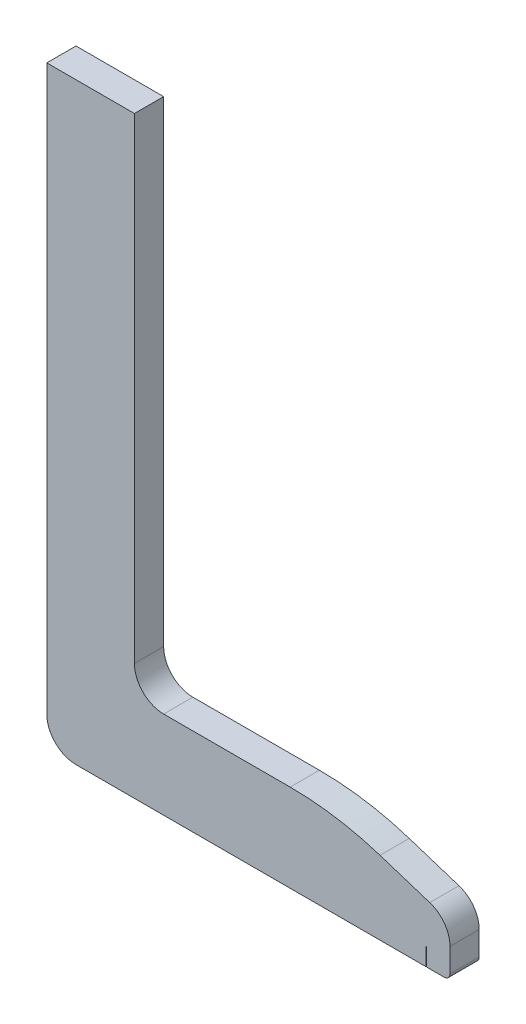
ISO-10303-21;
HEADER;
FILE_DESCRIPTION(('STEP AP214'),'2;1');
FILE_NAME('part.step','',(''),(''),'','','');
FILE_SCHEMA(('AUTOMOTIVE_DESIGN { 1 0 10303 214 1 1 1 1 }'));
ENDSEC;
DATA;
#1=APPLICATION_CONTEXT('core data for automotive mechanical design processes');
#2=APPLICATION_PROTOCOL_DEFINITION('international standard','automotive_design',2000,#1);
#3=PRODUCT_CONTEXT('',#1,'mechanical');
#4=PRODUCT('Part','Part','',(#3));
#5=PRODUCT_RELATED_PRODUCT_CATEGORY('part','',(#4));
#6=PRODUCT_DEFINITION_FORMATION('','',#4);
#7=PRODUCT_DEFINITION_CONTEXT('part definition',#1,'design');
#8=PRODUCT_DEFINITION('design','',#6,#7);
#9=PRODUCT_DEFINITION_SHAPE('','',#8);
#10=(LENGTH_UNIT() NAMED_UNIT(*) SI_UNIT(.MILLI.,.METRE.));
#11=(NAMED_UNIT(*) PLANE_ANGLE_UNIT() SI_UNIT($,.RADIAN.));
#12=(NAMED_UNIT(*) SI_UNIT($,.STERADIAN.) SOLID_ANGLE_UNIT());
#13=UNCERTAINTY_MEASURE_WITH_UNIT(LENGTH_MEASURE(1.E-05),#10,'distance_accuracy_value','');
#14=(GEOMETRIC_REPRESENTATION_CONTEXT(3) GLOBAL_UNCERTAINTY_ASSIGNED_CONTEXT((#13)) GLOBAL_UNIT_ASSIGNED_CONTEXT((#10,
#11,#12)) REPRESENTATION_CONTEXT('',''));
#15=CARTESIAN_POINT('',(0.,0.,0.));
#16=DIRECTION('',(0.,0.,1.));
#17=DIRECTION('',(1.,0.,0.));
#18=AXIS2_PLACEMENT_3D('',#15,#16,#17);
#19=CARTESIAN_POINT('',(5.,-101.5,5.));
#20=DIRECTION('',(0.,1.,0.));
#21=DIRECTION('',(-1.,0.,0.));
#22=AXIS2_PLACEMENT_3D('',#19,#20,#21);
#23=PLANE('',#22);
#24=DIRECTION('',(1.,0.,0.));
#25=VECTOR('',#24,1.);
#26=CARTESIAN_POINT('',(5.,-101.5,5.));
#27=LINE('',#26,#25);
#28=CARTESIAN_POINT('',(64.95,-101.5,5.));
#29=VERTEX_POINT('',#28);
#30=CARTESIAN_POINT('',(68.,-101.5,5.));
#31=VERTEX_POINT('',#30);
#32=EDGE_CURVE('E147',#29,#31,#27,.T.);
#33=ORIENTED_EDGE('',*,*,#32,.F.);
#34=DIRECTION('',(0.,0.,1.));
#35=VECTOR('',#34,1.);
#36=CARTESIAN_POINT('',(64.95,-101.5,0.));
#37=LINE('',#36,#35);
#38=CARTESIAN_POINT('',(64.95,-101.5,0.));
#39=VERTEX_POINT('',#38);
#40=EDGE_CURVE('E317',#39,#29,#37,.T.);
#41=ORIENTED_EDGE('',*,*,#40,.F.);
#42=DIRECTION('',(1.,0.,0.));
#43=VECTOR('',#42,1.);
#44=CARTESIAN_POINT('',(5.,-101.5,0.));
#45=LINE('',#44,#43);
#46=CARTESIAN_POINT('',(68.,-101.5,0.));
#47=VERTEX_POINT('',#46);
#48=EDGE_CURVE('E166',#39,#47,#45,.T.);
#49=ORIENTED_EDGE('',*,*,#48,.T.);
#50=DIRECTION('',(0.,0.,-1.));
#51=VECTOR('',#50,1.);
#52=CARTESIAN_POINT('',(68.,-101.5,5.));
#53=LINE('',#52,#51);
#54=EDGE_CURVE('E164',#31,#47,#53,.T.);
#55=ORIENTED_EDGE('',*,*,#54,.F.);
#56=EDGE_LOOP('',(#33,#41,#49,#55));
#57=FACE_BOUND('',#56,.T.);
#58=ADVANCED_FACE('F40',(#57),#23,.F.);
#59=CARTESIAN_POINT('',(64.,-96.4299960458087,5.));
#60=DIRECTION('',(0.,0.,-1.));
#61=DIRECTION('',(-1.,0.,0.));
#62=AXIS2_PLACEMENT_3D('',#59,#60,#61);
#63=CYLINDRICAL_SURFACE('',#62,5.);
#64=CARTESIAN_POINT('',(64.,-96.4299960458087,0.));
#65=DIRECTION('',(0.,0.,1.));
#66=DIRECTION('',(-1.,0.,0.));
#67=AXIS2_PLACEMENT_3D('',#64,#65,#66);
#68=CIRCLE('',#67,5.);
#69=CARTESIAN_POINT('',(69.,-96.4299960458087,0.));
#70=VERTEX_POINT('',#69);
#71=CARTESIAN_POINT('',(65.5368774299289,-91.6720544987345,0.));
#72=VERTEX_POINT('',#71);
#73=EDGE_CURVE('E183',#70,#72,#68,.T.);
#74=ORIENTED_EDGE('',*,*,#73,.T.);
#75=DIRECTION('',(0.,0.,-1.));
#76=VECTOR('',#75,1.);
#77=CARTESIAN_POINT('',(65.5368774299289,-91.6720544987345,5.));
#78=LINE('',#77,#76);
#79=CARTESIAN_POINT('',(65.5368774299289,-91.6720544987345,5.));
#80=VERTEX_POINT('',#79);
#81=EDGE_CURVE('E12',#80,#72,#78,.T.);
#82=ORIENTED_EDGE('',*,*,#81,.F.);
#83=CARTESIAN_POINT('',(64.,-96.4299960458087,5.));
#84=DIRECTION('',(0.,0.,1.));
#85=DIRECTION('',(-1.,0.,0.));
#86=AXIS2_PLACEMENT_3D('',#83,#84,#85);
#87=CIRCLE('',#86,5.);
#88=CARTESIAN_POINT('',(69.,-96.4299960458087,5.));
#89=VERTEX_POINT('',#88);
#90=EDGE_CURVE('E223',#89,#80,#87,.T.);
#91=ORIENTED_EDGE('',*,*,#90,.F.);
#92=DIRECTION('',(0.,0.,-1.));
#93=VECTOR('',#92,1.);
#94=CARTESIAN_POINT('',(69.,-96.4299960458087,5.));
#95=LINE('',#94,#93);
#96=EDGE_CURVE('E178',#89,#70,#95,.T.);
#97=ORIENTED_EDGE('',*,*,#96,.T.);
#98=EDGE_LOOP('',(#74,#82,#91,#97));
#99=FACE_BOUND('',#98,.T.);
#100=ADVANCED_FACE('F42',(#99),#63,.T.);
#101=CARTESIAN_POINT('',(65.5368774299289,-91.6720544987345,5.));
#102=DIRECTION('',(-0.307375485985788,-0.951588309414844,0.));
#103=DIRECTION('',(0.951588309414844,-0.307375485985788,0.));
#104=AXIS2_PLACEMENT_3D('',#101,#102,#103);
#105=PLANE('',#104);
#106=DIRECTION('',(-0.951588309414844,0.307375485985788,0.));
#107=VECTOR('',#106,1.);
#108=CARTESIAN_POINT('',(65.5368774299289,-91.6720544987345,0.));
#109=LINE('',#108,#107);
#110=CARTESIAN_POINT('',(57.0187399204818,-88.9205845292578,0.));
#111=VERTEX_POINT('',#110);
#112=EDGE_CURVE('E187',#72,#111,#109,.T.);
#113=ORIENTED_EDGE('',*,*,#112,.T.);
#114=DIRECTION('',(0.,0.,-1.));
#115=VECTOR('',#114,1.);
#116=CARTESIAN_POINT('',(57.0187399204818,-88.9205845292578,5.));
#117=LINE('',#116,#115);
#118=CARTESIAN_POINT('',(57.0187399204818,-88.9205845292578,5.));
#119=VERTEX_POINT('',#118);
#120=EDGE_CURVE('E49',#119,#111,#117,.T.);
#121=ORIENTED_EDGE('',*,*,#120,.F.);
#122=DIRECTION('',(-0.951588309414844,0.307375485985788,0.));
#123=VECTOR('',#122,1.);
#124=CARTESIAN_POINT('',(65.5368774299289,-91.6720544987345,5.));
#125=LINE('',#124,#123);
#126=EDGE_CURVE('E118',#80,#119,#125,.T.);
#127=ORIENTED_EDGE('',*,*,#126,.F.);
#128=ORIENTED_EDGE('',*,*,#81,.T.);
#129=EDGE_LOOP('',(#113,#121,#127,#128));
#130=FACE_BOUND('',#129,.T.);
#131=ADVANCED_FACE('F347',(#130),#105,.F.);
#132=CARTESIAN_POINT('',(41.6499656211925,-136.5,5.));
#133=DIRECTION('',(0.,0.,-1.));
#134=DIRECTION('',(-1.,0.,0.));
#135=AXIS2_PLACEMENT_3D('',#132,#133,#134);
#136=CYLINDRICAL_SURFACE('',#135,50.);
#137=CARTESIAN_POINT('',(41.6499656211925,-136.5,0.));
#138=DIRECTION('',(0.,0.,1.));
#139=DIRECTION('',(-1.,0.,0.));
#140=AXIS2_PLACEMENT_3D('',#137,#138,#139);
#141=CIRCLE('',#140,50.);
#142=CARTESIAN_POINT('',(41.6499656211925,-86.5,0.));
#143=VERTEX_POINT('',#142);
#144=EDGE_CURVE('E191',#111,#143,#141,.T.);
#145=ORIENTED_EDGE('',*,*,#144,.T.);
#146=DIRECTION('',(0.,0.,-1.));
#147=VECTOR('',#146,1.);
#148=CARTESIAN_POINT('',(41.6499656211925,-86.5,5.));
#149=LINE('',#148,#147);
#150=CARTESIAN_POINT('',(41.6499656211925,-86.5,5.));
#151=VERTEX_POINT('',#150);
#152=EDGE_CURVE('E251',#151,#143,#149,.T.);
#153=ORIENTED_EDGE('',*,*,#152,.F.);
#154=CARTESIAN_POINT('',(41.6499656211925,-136.5,5.));
#155=DIRECTION('',(0.,0.,1.));
#156=DIRECTION('',(-1.,0.,0.));
#157=AXIS2_PLACEMENT_3D('',#154,#155,#156);
#158=CIRCLE('',#157,50.);
#159=EDGE_CURVE('E261',#119,#151,#158,.T.);
#160=ORIENTED_EDGE('',*,*,#159,.F.);
#161=ORIENTED_EDGE('',*,*,#120,.T.);
#162=EDGE_LOOP('',(#145,#153,#160,#161));
#163=FACE_BOUND('',#162,.T.);
#164=ADVANCED_FACE('F259',(#163),#136,.T.);
#165=CARTESIAN_POINT('',(41.6499656211925,-86.5,5.));
#166=DIRECTION('',(0.,-1.,0.));
#167=DIRECTION('',(1.,0.,0.));
#168=AXIS2_PLACEMENT_3D('',#165,#166,#167);
#169=PLANE('',#168);
#170=DIRECTION('',(-1.,0.,0.));
#171=VECTOR('',#170,1.);
#172=CARTESIAN_POINT('',(41.6499656211925,-86.5,0.));
#173=LINE('',#172,#171);
#174=CARTESIAN_POINT('',(20.,-86.5,0.));
#175=VERTEX_POINT('',#174);
#176=EDGE_CURVE('E194',#143,#175,#173,.T.);
#177=ORIENTED_EDGE('',*,*,#176,.T.);
#178=DIRECTION('',(0.,0.,-1.));
#179=VECTOR('',#178,1.);
#180=CARTESIAN_POINT('',(20.,-86.5,5.));
#181=LINE('',#180,#179);
#182=CARTESIAN_POINT('',(20.,-86.5,5.));
#183=VERTEX_POINT('',#182);
#184=EDGE_CURVE('E247',#183,#175,#181,.T.);
#185=ORIENTED_EDGE('',*,*,#184,.F.);
#186=DIRECTION('',(-1.,0.,0.));
#187=VECTOR('',#186,1.);
#188=CARTESIAN_POINT('',(41.6499656211925,-86.5,5.));
#189=LINE('',#188,#187);
#190=EDGE_CURVE('E280',#151,#183,#189,.T.);
#191=ORIENTED_EDGE('',*,*,#190,.F.);
#192=ORIENTED_EDGE('',*,*,#152,.T.);
#193=EDGE_LOOP('',(#177,#185,#191,#192));
#194=FACE_BOUND('',#193,.T.);
#195=ADVANCED_FACE('F270',(#194),#169,.F.);
#196=CARTESIAN_POINT('',(20.,-81.5,5.));
#197=DIRECTION('',(0.,0.,-1.));
#198=DIRECTION('',(-1.,0.,0.));
#199=AXIS2_PLACEMENT_3D('',#196,#197,#198);
#200=CYLINDRICAL_SURFACE('',#199,5.00000000000001);
#201=CARTESIAN_POINT('',(20.,-81.5,0.));
#202=DIRECTION('',(0.,0.,-1.));
#203=DIRECTION('',(1.,0.,0.));
#204=AXIS2_PLACEMENT_3D('',#201,#202,#203);
#205=CIRCLE('',#204,5.00000000000001);
#206=CARTESIAN_POINT('',(15.,-81.5,0.));
#207=VERTEX_POINT('',#206);
#208=EDGE_CURVE('E197',#175,#207,#205,.T.);
#209=ORIENTED_EDGE('',*,*,#208,.T.);
#210=DIRECTION('',(0.,0.,-1.));
#211=VECTOR('',#210,1.);
#212=CARTESIAN_POINT('',(15.,-81.5,5.));
#213=LINE('',#212,#211);
#214=CARTESIAN_POINT('',(15.,-81.5,5.));
#215=VERTEX_POINT('',#214);
#216=EDGE_CURVE('E243',#215,#207,#213,.T.);
#217=ORIENTED_EDGE('',*,*,#216,.F.);
#218=CARTESIAN_POINT('',(20.,-81.5,5.));
#219=DIRECTION('',(0.,0.,-1.));
#220=DIRECTION('',(1.,0.,0.));
#221=AXIS2_PLACEMENT_3D('',#218,#219,#220);
#222=CIRCLE('',#221,5.00000000000001);
#223=EDGE_CURVE('E276',#183,#215,#222,.T.);
#224=ORIENTED_EDGE('',*,*,#223,.F.);
#225=ORIENTED_EDGE('',*,*,#184,.T.);
#226=EDGE_LOOP('',(#209,#217,#224,#225));
#227=FACE_BOUND('',#226,.T.);
#228=ADVANCED_FACE('F274',(#227),#200,.F.);
#229=CARTESIAN_POINT('',(15.,-61.,5.));
#230=DIRECTION('',(-1.,0.,0.));
#231=DIRECTION('',(0.,-1.,0.));
#232=AXIS2_PLACEMENT_3D('',#229,#230,#231);
#233=PLANE('',#232);
#234=DIRECTION('',(0.,1.,0.));
#235=VECTOR('',#234,1.);
#236=CARTESIAN_POINT('',(15.,-61.,0.));
#237=LINE('',#236,#235);
#238=CARTESIAN_POINT('',(15.,0.,0.));
#239=VERTEX_POINT('',#238);
#240=EDGE_CURVE('E201',#207,#239,#237,.T.);
#241=ORIENTED_EDGE('',*,*,#240,.T.);
#242=DIRECTION('',(0.,0.,-1.));
#243=VECTOR('',#242,1.);
#244=CARTESIAN_POINT('',(15.,0.,5.));
#245=LINE('',#244,#243);
#246=CARTESIAN_POINT('',(15.,0.,5.));
#247=VERTEX_POINT('',#246);
#248=EDGE_CURVE('E239',#247,#239,#245,.T.);
#249=ORIENTED_EDGE('',*,*,#248,.F.);
#250=DIRECTION('',(0.,1.,0.));
#251=VECTOR('',#250,1.);
#252=CARTESIAN_POINT('',(15.,-81.5,5.));
#253=LINE('',#252,#251);
#254=EDGE_CURVE('E279',#215,#247,#253,.T.);
#255=ORIENTED_EDGE('',*,*,#254,.F.);
#256=ORIENTED_EDGE('',*,*,#216,.T.);
#257=EDGE_LOOP('',(#241,#249,#255,#256));
#258=FACE_BOUND('',#257,.T.);
#259=ADVANCED_FACE('F376',(#258),#233,.F.);
#260=CARTESIAN_POINT('',(0.,0.,5.));
#261=DIRECTION('',(0.,-1.,0.));
#262=DIRECTION('',(1.,0.,0.));
#263=AXIS2_PLACEMENT_3D('',#260,#261,#262);
#264=PLANE('',#263);
#265=DIRECTION('',(-1.,0.,0.));
#266=VECTOR('',#265,1.);
#267=CARTESIAN_POINT('',(0.,0.,0.));
#268=LINE('',#267,#266);
#269=CARTESIAN_POINT('',(0.,0.,0.));
#270=VERTEX_POINT('',#269);
#271=EDGE_CURVE('E204',#239,#270,#268,.T.);
#272=ORIENTED_EDGE('',*,*,#271,.T.);
#273=DIRECTION('',(0.,0.,-1.));
#274=VECTOR('',#273,1.);
#275=CARTESIAN_POINT('',(0.,0.,5.));
#276=LINE('',#275,#274);
#277=CARTESIAN_POINT('',(0.,0.,5.));
#278=VERTEX_POINT('',#277);
#279=EDGE_CURVE('E235',#278,#270,#276,.T.);
#280=ORIENTED_EDGE('',*,*,#279,.F.);
#281=DIRECTION('',(-1.,0.,0.));
#282=VECTOR('',#281,1.);
#283=CARTESIAN_POINT('',(0.,0.,5.));
#284=LINE('',#283,#282);
#285=EDGE_CURVE('E284',#247,#278,#284,.T.);
#286=ORIENTED_EDGE('',*,*,#285,.F.);
#287=ORIENTED_EDGE('',*,*,#248,.T.);
#288=EDGE_LOOP('',(#272,#280,#286,#287));
#289=FACE_BOUND('',#288,.T.);
#290=ADVANCED_FACE('F370',(#289),#264,.F.);
#291=CARTESIAN_POINT('',(0.,-1.00000000000001,5.));
#292=DIRECTION('',(1.,0.,0.));
#293=DIRECTION('',(0.,1.,0.));
#294=AXIS2_PLACEMENT_3D('',#291,#292,#293);
#295=PLANE('',#294);
#296=DIRECTION('',(0.,-1.,0.));
#297=VECTOR('',#296,1.);
#298=CARTESIAN_POINT('',(0.,-1.00000000000001,0.));
#299=LINE('',#298,#297);
#300=CARTESIAN_POINT('',(0.,-96.5,0.));
#301=VERTEX_POINT('',#300);
#302=EDGE_CURVE('E208',#270,#301,#299,.T.);
#303=ORIENTED_EDGE('',*,*,#302,.T.);
#304=DIRECTION('',(0.,0.,-1.));
#305=VECTOR('',#304,1.);
#306=CARTESIAN_POINT('',(0.,-96.5,5.));
#307=LINE('',#306,#305);
#308=CARTESIAN_POINT('',(0.,-96.5,5.));
#309=VERTEX_POINT('',#308);
#310=EDGE_CURVE('E231',#309,#301,#307,.T.);
#311=ORIENTED_EDGE('',*,*,#310,.F.);
#312=DIRECTION('',(0.,-1.,0.));
#313=VECTOR('',#312,1.);
#314=CARTESIAN_POINT('',(0.,-1.00000000000001,5.));
#315=LINE('',#314,#313);
#316=EDGE_CURVE('E291',#278,#309,#315,.T.);
#317=ORIENTED_EDGE('',*,*,#316,.F.);
#318=ORIENTED_EDGE('',*,*,#279,.T.);
#319=EDGE_LOOP('',(#303,#311,#317,#318));
#320=FACE_BOUND('',#319,.T.);
#321=ADVANCED_FACE('F366',(#320),#295,.F.);
#322=CARTESIAN_POINT('',(5.,-96.5,5.));
#323=DIRECTION('',(0.,0.,-1.));
#324=DIRECTION('',(-1.,0.,0.));
#325=AXIS2_PLACEMENT_3D('',#322,#323,#324);
#326=CYLINDRICAL_SURFACE('',#325,5.);
#327=CARTESIAN_POINT('',(5.,-96.5,0.));
#328=DIRECTION('',(0.,0.,1.));
#329=DIRECTION('',(-1.,0.,0.));
#330=AXIS2_PLACEMENT_3D('',#327,#328,#329);
#331=CIRCLE('',#330,5.);
#332=CARTESIAN_POINT('',(5.,-101.5,0.));
#333=VERTEX_POINT('',#332);
#334=EDGE_CURVE('E211',#301,#333,#331,.T.);
#335=ORIENTED_EDGE('',*,*,#334,.T.);
#336=DIRECTION('',(0.,0.,-1.));
#337=VECTOR('',#336,1.);
#338=CARTESIAN_POINT('',(5.,-101.5,5.));
#339=LINE('',#338,#337);
#340=CARTESIAN_POINT('',(5.,-101.5,5.));
#341=VERTEX_POINT('',#340);
#342=EDGE_CURVE('E170',#341,#333,#339,.T.);
#343=ORIENTED_EDGE('',*,*,#342,.F.);
#344=CARTESIAN_POINT('',(5.,-96.5,5.));
#345=DIRECTION('',(0.,0.,1.));
#346=DIRECTION('',(-1.,0.,0.));
#347=AXIS2_PLACEMENT_3D('',#344,#345,#346);
#348=CIRCLE('',#347,5.);
#349=EDGE_CURVE('E161',#309,#341,#348,.T.);
#350=ORIENTED_EDGE('',*,*,#349,.F.);
#351=ORIENTED_EDGE('',*,*,#310,.T.);
#352=EDGE_LOOP('',(#335,#343,#350,#351));
#353=FACE_BOUND('',#352,.T.);
#354=ADVANCED_FACE('F302',(#353),#326,.T.);
#355=CARTESIAN_POINT('',(64.8500000000001,-101.5,0.));
#356=VERTEX_POINT('',#355);
#357=EDGE_CURVE('E214',#333,#356,#45,.T.);
#358=ORIENTED_EDGE('',*,*,#357,.T.);
#359=DIRECTION('',(0.,0.,-1.));
#360=VECTOR('',#359,1.);
#361=CARTESIAN_POINT('',(64.8500000000001,-101.5,0.));
#362=LINE('',#361,#360);
#363=CARTESIAN_POINT('',(64.8500000000001,-101.5,5.));
#364=VERTEX_POINT('',#363);
#365=EDGE_CURVE('E309',#364,#356,#362,.T.);
#366=ORIENTED_EDGE('',*,*,#365,.F.);
#367=EDGE_CURVE('E160',#341,#364,#27,.T.);
#368=ORIENTED_EDGE('',*,*,#367,.F.);
#369=ORIENTED_EDGE('',*,*,#342,.T.);
#370=EDGE_LOOP('',(#358,#366,#368,#369));
#371=FACE_BOUND('',#370,.T.);
#372=ADVANCED_FACE('F307',(#371),#23,.F.);
#373=CARTESIAN_POINT('',(68.,-100.5,5.));
#374=DIRECTION('',(0.,0.,-1.));
#375=DIRECTION('',(-1.,0.,0.));
#376=AXIS2_PLACEMENT_3D('',#373,#374,#375);
#377=CYLINDRICAL_SURFACE('',#376,0.999999999999994);
#378=CARTESIAN_POINT('',(68.,-100.5,0.));
#379=DIRECTION('',(0.,0.,1.));
#380=DIRECTION('',(-1.,0.,0.));
#381=AXIS2_PLACEMENT_3D('',#378,#379,#380);
#382=CIRCLE('',#381,0.999999999999994);
#383=CARTESIAN_POINT('',(69.,-100.5,0.));
#384=VERTEX_POINT('',#383);
#385=EDGE_CURVE('E218',#47,#384,#382,.T.);
#386=ORIENTED_EDGE('',*,*,#385,.T.);
#387=DIRECTION('',(0.,0.,-1.));
#388=VECTOR('',#387,1.);
#389=CARTESIAN_POINT('',(69.,-100.5,5.));
#390=LINE('',#389,#388);
#391=CARTESIAN_POINT('',(69.,-100.5,5.));
#392=VERTEX_POINT('',#391);
#393=EDGE_CURVE('E171',#392,#384,#390,.T.);
#394=ORIENTED_EDGE('',*,*,#393,.F.);
#395=CARTESIAN_POINT('',(68.,-100.5,5.));
#396=DIRECTION('',(0.,0.,1.));
#397=DIRECTION('',(-1.,0.,0.));
#398=AXIS2_PLACEMENT_3D('',#395,#396,#397);
#399=CIRCLE('',#398,0.999999999999994);
#400=EDGE_CURVE('E152',#31,#392,#399,.T.);
#401=ORIENTED_EDGE('',*,*,#400,.F.);
#402=ORIENTED_EDGE('',*,*,#54,.T.);
#403=EDGE_LOOP('',(#386,#394,#401,#402));
#404=FACE_BOUND('',#403,.T.);
#405=ADVANCED_FACE('F173',(#404),#377,.T.);
#406=CARTESIAN_POINT('',(69.,-100.5,5.));
#407=DIRECTION('',(-1.,0.,0.));
#408=DIRECTION('',(0.,0.,1.));
#409=AXIS2_PLACEMENT_3D('',#406,#407,#408);
#410=PLANE('',#409);
#411=DIRECTION('',(0.,1.,0.));
#412=VECTOR('',#411,1.);
#413=CARTESIAN_POINT('',(69.,-100.5,0.));
#414=LINE('',#413,#412);
#415=EDGE_CURVE('E110',#384,#70,#414,.T.);
#416=ORIENTED_EDGE('',*,*,#415,.T.);
#417=ORIENTED_EDGE('',*,*,#96,.F.);
#418=DIRECTION('',(0.,1.,0.));
#419=VECTOR('',#418,1.);
#420=CARTESIAN_POINT('',(69.,-100.5,5.));
#421=LINE('',#420,#419);
#422=EDGE_CURVE('E65',#392,#89,#421,.T.);
#423=ORIENTED_EDGE('',*,*,#422,.F.);
#424=ORIENTED_EDGE('',*,*,#393,.T.);
#425=EDGE_LOOP('',(#416,#417,#423,#424));
#426=FACE_BOUND('',#425,.T.);
#427=ADVANCED_FACE('F365',(#426),#410,.F.);
#428=CARTESIAN_POINT('',(64.,-96.4299960458087,5.));
#429=DIRECTION('',(0.,0.,-1.));
#430=DIRECTION('',(-1.,0.,0.));
#431=AXIS2_PLACEMENT_3D('',#428,#429,#430);
#432=PLANE('',#431);
#433=DIRECTION('',(-1.,0.,0.));
#434=VECTOR('',#433,1.);
#435=CARTESIAN_POINT('',(64.8500000000001,-98.5,5.));
#436=LINE('',#435,#434);
#437=CARTESIAN_POINT('',(64.95,-98.5,5.));
#438=VERTEX_POINT('',#437);
#439=CARTESIAN_POINT('',(64.8500000000001,-98.5,5.));
#440=VERTEX_POINT('',#439);
#441=EDGE_CURVE('E322',#438,#440,#436,.T.);
#442=ORIENTED_EDGE('',*,*,#441,.F.);
#443=DIRECTION('',(0.,-1.,0.));
#444=VECTOR('',#443,1.);
#445=CARTESIAN_POINT('',(64.95,-98.5,5.));
#446=LINE('',#445,#444);
#447=EDGE_CURVE('E156',#438,#29,#446,.T.);
#448=ORIENTED_EDGE('',*,*,#447,.T.);
#449=ORIENTED_EDGE('',*,*,#32,.T.);
#450=ORIENTED_EDGE('',*,*,#400,.T.);
#451=ORIENTED_EDGE('',*,*,#422,.T.);
#452=ORIENTED_EDGE('',*,*,#90,.T.);
#453=ORIENTED_EDGE('',*,*,#126,.T.);
#454=ORIENTED_EDGE('',*,*,#159,.T.);
#455=ORIENTED_EDGE('',*,*,#190,.T.);
#456=ORIENTED_EDGE('',*,*,#223,.T.);
#457=ORIENTED_EDGE('',*,*,#254,.T.);
#458=ORIENTED_EDGE('',*,*,#285,.T.);
#459=ORIENTED_EDGE('',*,*,#316,.T.);
#460=ORIENTED_EDGE('',*,*,#349,.T.);
#461=ORIENTED_EDGE('',*,*,#367,.T.);
#462=DIRECTION('',(0.,-1.,0.));
#463=VECTOR('',#462,1.);
#464=CARTESIAN_POINT('',(64.8500000000001,-98.5,5.));
#465=LINE('',#464,#463);
#466=EDGE_CURVE('E334',#440,#364,#465,.T.);
#467=ORIENTED_EDGE('',*,*,#466,.F.);
#468=EDGE_LOOP('',(#442,#448,#449,#450,#451,#452,#453,#454,#455,#456,#457,#458,#459,#460,#461,#467));
#469=FACE_BOUND('',#468,.T.);
#470=ADVANCED_FACE('F150',(#469),#432,.F.);
#471=CARTESIAN_POINT('',(64.,-96.4299960458087,0.));
#472=DIRECTION('',(0.,0.,-1.));
#473=DIRECTION('',(-1.,0.,0.));
#474=AXIS2_PLACEMENT_3D('',#471,#472,#473);
#475=PLANE('',#474);
#476=DIRECTION('',(0.,-1.,0.));
#477=VECTOR('',#476,1.);
#478=CARTESIAN_POINT('',(64.95,-98.5,0.));
#479=LINE('',#478,#477);
#480=CARTESIAN_POINT('',(64.95,-98.5,0.));
#481=VERTEX_POINT('',#480);
#482=EDGE_CURVE('E188',#481,#39,#479,.T.);
#483=ORIENTED_EDGE('',*,*,#482,.F.);
#484=DIRECTION('',(1.,0.,0.));
#485=VECTOR('',#484,1.);
#486=CARTESIAN_POINT('',(64.8500000000001,-98.5,0.));
#487=LINE('',#486,#485);
#488=CARTESIAN_POINT('',(64.8500000000001,-98.5,0.));
#489=VERTEX_POINT('',#488);
#490=EDGE_CURVE('E339',#489,#481,#487,.T.);
#491=ORIENTED_EDGE('',*,*,#490,.F.);
#492=DIRECTION('',(0.,-1.,0.));
#493=VECTOR('',#492,1.);
#494=CARTESIAN_POINT('',(64.8500000000001,-98.5,0.));
#495=LINE('',#494,#493);
#496=EDGE_CURVE('E331',#489,#356,#495,.T.);
#497=ORIENTED_EDGE('',*,*,#496,.T.);
#498=ORIENTED_EDGE('',*,*,#357,.F.);
#499=ORIENTED_EDGE('',*,*,#334,.F.);
#500=ORIENTED_EDGE('',*,*,#302,.F.);
#501=ORIENTED_EDGE('',*,*,#271,.F.);
#502=ORIENTED_EDGE('',*,*,#240,.F.);
#503=ORIENTED_EDGE('',*,*,#208,.F.);
#504=ORIENTED_EDGE('',*,*,#176,.F.);
#505=ORIENTED_EDGE('',*,*,#144,.F.);
#506=ORIENTED_EDGE('',*,*,#112,.F.);
#507=ORIENTED_EDGE('',*,*,#73,.F.);
#508=ORIENTED_EDGE('',*,*,#415,.F.);
#509=ORIENTED_EDGE('',*,*,#385,.F.);
#510=ORIENTED_EDGE('',*,*,#48,.F.);
#511=EDGE_LOOP('',(#483,#491,#497,#498,#499,#500,#501,#502,#503,#504,#505,#506,#507,#508,#509,#510));
#512=FACE_BOUND('',#511,.T.);
#513=ADVANCED_FACE('F265',(#512),#475,.T.);
#514=CARTESIAN_POINT('',(64.95,-98.5,0.));
#515=DIRECTION('',(1.,0.,0.));
#516=DIRECTION('',(0.,0.,-1.));
#517=AXIS2_PLACEMENT_3D('',#514,#515,#516);
#518=PLANE('',#517);
#519=ORIENTED_EDGE('',*,*,#40,.T.);
#520=ORIENTED_EDGE('',*,*,#447,.F.);
#521=DIRECTION('',(0.,0.,1.));
#522=VECTOR('',#521,1.);
#523=CARTESIAN_POINT('',(64.95,-98.5,0.));
#524=LINE('',#523,#522);
#525=EDGE_CURVE('E316',#481,#438,#524,.T.);
#526=ORIENTED_EDGE('',*,*,#525,.F.);
#527=ORIENTED_EDGE('',*,*,#482,.T.);
#528=EDGE_LOOP('',(#519,#520,#526,#527));
#529=FACE_BOUND('',#528,.T.);
#530=ADVANCED_FACE('F449',(#529),#518,.F.);
#531=CARTESIAN_POINT('',(64.8500000000001,-98.5,0.));
#532=DIRECTION('',(-1.,0.,0.));
#533=DIRECTION('',(0.,0.,1.));
#534=AXIS2_PLACEMENT_3D('',#531,#532,#533);
#535=PLANE('',#534);
#536=ORIENTED_EDGE('',*,*,#365,.T.);
#537=ORIENTED_EDGE('',*,*,#496,.F.);
#538=DIRECTION('',(0.,0.,-1.));
#539=VECTOR('',#538,1.);
#540=CARTESIAN_POINT('',(64.8500000000001,-98.5,0.));
#541=LINE('',#540,#539);
#542=EDGE_CURVE('E56',#440,#489,#541,.T.);
#543=ORIENTED_EDGE('',*,*,#542,.F.);
#544=ORIENTED_EDGE('',*,*,#466,.T.);
#545=EDGE_LOOP('',(#536,#537,#543,#544));
#546=FACE_BOUND('',#545,.T.);
#547=ADVANCED_FACE('F457',(#546),#535,.F.);
#548=CARTESIAN_POINT('',(0.,-98.5,0.));
#549=DIRECTION('',(0.,1.,0.));
#550=DIRECTION('',(0.,0.,1.));
#551=AXIS2_PLACEMENT_3D('',#548,#549,#550);
#552=PLANE('',#551);
#553=ORIENTED_EDGE('',*,*,#525,.T.);
#554=ORIENTED_EDGE('',*,*,#441,.T.);
#555=ORIENTED_EDGE('',*,*,#542,.T.);
#556=ORIENTED_EDGE('',*,*,#490,.T.);
#557=EDGE_LOOP('',(#553,#554,#555,#556));
#558=FACE_BOUND('',#557,.T.);
#559=ADVANCED_FACE('F467',(#558),#552,.F.);
#560=CLOSED_SHELL('',(#58,#100,#131,#164,#195,#228,#259,#290,#321,#354,#372,#405,#427,#470,#513,
#530,#547,#559));
#561=MANIFOLD_SOLID_BREP('B2',#560);
#562=ADVANCED_BREP_SHAPE_REPRESENTATION('',(#18,#561),#14);
#563=SHAPE_DEFINITION_REPRESENTATION(#9,#562);
ENDSEC;
END-ISO-10303-21;
